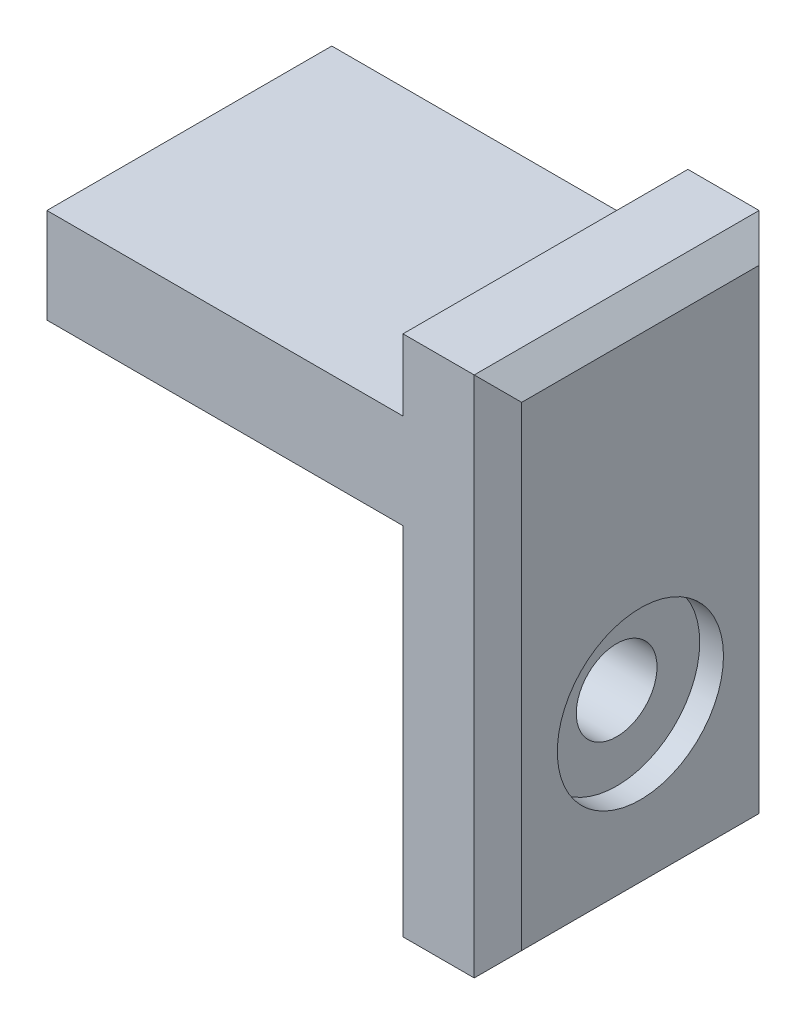
ISO-10303-21;
HEADER;
FILE_DESCRIPTION(('STEP AP214'),'2;1');
FILE_NAME('part.step','',(''),(''),'','','');
FILE_SCHEMA(('AUTOMOTIVE_DESIGN { 1 0 10303 214 1 1 1 1 }'));
ENDSEC;
DATA;
#1=APPLICATION_CONTEXT('core data for automotive mechanical design processes');
#2=APPLICATION_PROTOCOL_DEFINITION('international standard','automotive_design',2000,#1);
#3=PRODUCT_CONTEXT('',#1,'mechanical');
#4=PRODUCT('Part','Part','',(#3));
#5=PRODUCT_RELATED_PRODUCT_CATEGORY('part','',(#4));
#6=PRODUCT_DEFINITION_FORMATION('','',#4);
#7=PRODUCT_DEFINITION_CONTEXT('part definition',#1,'design');
#8=PRODUCT_DEFINITION('design','',#6,#7);
#9=PRODUCT_DEFINITION_SHAPE('','',#8);
#10=(LENGTH_UNIT() NAMED_UNIT(*) SI_UNIT(.MILLI.,.METRE.));
#11=(NAMED_UNIT(*) PLANE_ANGLE_UNIT() SI_UNIT($,.RADIAN.));
#12=(NAMED_UNIT(*) SI_UNIT($,.STERADIAN.) SOLID_ANGLE_UNIT());
#13=UNCERTAINTY_MEASURE_WITH_UNIT(LENGTH_MEASURE(1.E-05),#10,'distance_accuracy_value','');
#14=(GEOMETRIC_REPRESENTATION_CONTEXT(3) GLOBAL_UNCERTAINTY_ASSIGNED_CONTEXT((#13)) GLOBAL_UNIT_ASSIGNED_CONTEXT((#10,
#11,#12)) REPRESENTATION_CONTEXT('',''));
#15=CARTESIAN_POINT('',(0.,0.,0.));
#16=DIRECTION('',(0.,0.,1.));
#17=DIRECTION('',(1.,0.,0.));
#18=AXIS2_PLACEMENT_3D('',#15,#16,#17);
#19=CARTESIAN_POINT('',(27.,7.5,6.));
#20=DIRECTION('',(-1.,0.,0.));
#21=DIRECTION('',(0.,-1.,0.));
#22=AXIS2_PLACEMENT_3D('',#19,#20,#21);
#23=CYLINDRICAL_SURFACE('',#22,1.7);
#24=CARTESIAN_POINT('',(15.,7.5,6.));
#25=DIRECTION('',(-1.,0.,0.));
#26=DIRECTION('',(0.,-1.,0.));
#27=AXIS2_PLACEMENT_3D('',#24,#25,#26);
#28=CIRCLE('',#27,1.7);
#29=CARTESIAN_POINT('',(15.,5.8,6.));
#30=VERTEX_POINT('',#29);
#31=EDGE_CURVE('E144',#30,#30,#28,.T.);
#32=ORIENTED_EDGE('',*,*,#31,.T.);
#33=EDGE_LOOP('',(#32));
#34=FACE_BOUND('',#33,.T.);
#35=CARTESIAN_POINT('',(18.,7.5,6.));
#36=DIRECTION('',(1.,0.,0.));
#37=DIRECTION('',(0.,0.,-1.));
#38=AXIS2_PLACEMENT_3D('',#35,#36,#37);
#39=CIRCLE('',#38,1.7);
#40=CARTESIAN_POINT('',(18.,7.5,4.3));
#41=VERTEX_POINT('',#40);
#42=EDGE_CURVE('E142',#41,#41,#39,.F.);
#43=ORIENTED_EDGE('',*,*,#42,.F.);
#44=EDGE_LOOP('',(#43));
#45=FACE_BOUND('',#44,.T.);
#46=ADVANCED_FACE('F35',(#34,#45),#23,.F.);
#47=CARTESIAN_POINT('',(15.,0.,12.));
#48=DIRECTION('',(1.,0.,0.));
#49=DIRECTION('',(0.,1.,0.));
#50=AXIS2_PLACEMENT_3D('',#47,#48,#49);
#51=PLANE('',#50);
#52=ORIENTED_EDGE('',*,*,#31,.F.);
#53=EDGE_LOOP('',(#52));
#54=FACE_BOUND('',#53,.T.);
#55=DIRECTION('',(0.,-1.,0.));
#56=VECTOR('',#55,1.);
#57=CARTESIAN_POINT('',(15.,0.,0.));
#58=LINE('',#57,#56);
#59=CARTESIAN_POINT('',(15.,15.,0.));
#60=VERTEX_POINT('',#59);
#61=CARTESIAN_POINT('',(15.,0.,0.));
#62=VERTEX_POINT('',#61);
#63=EDGE_CURVE('E131',#60,#62,#58,.T.);
#64=ORIENTED_EDGE('',*,*,#63,.T.);
#65=DIRECTION('',(0.,0.,-1.));
#66=VECTOR('',#65,1.);
#67=CARTESIAN_POINT('',(15.,0.,12.));
#68=LINE('',#67,#66);
#69=CARTESIAN_POINT('',(15.,0.,12.));
#70=VERTEX_POINT('',#69);
#71=EDGE_CURVE('E115',#70,#62,#68,.T.);
#72=ORIENTED_EDGE('',*,*,#71,.F.);
#73=DIRECTION('',(0.,-1.,0.));
#74=VECTOR('',#73,1.);
#75=CARTESIAN_POINT('',(15.,0.,12.));
#76=LINE('',#75,#74);
#77=CARTESIAN_POINT('',(15.,15.,12.));
#78=VERTEX_POINT('',#77);
#79=EDGE_CURVE('E118',#78,#70,#76,.T.);
#80=ORIENTED_EDGE('',*,*,#79,.F.);
#81=DIRECTION('',(0.,0.,-1.));
#82=VECTOR('',#81,1.);
#83=CARTESIAN_POINT('',(15.,15.,12.));
#84=LINE('',#83,#82);
#85=EDGE_CURVE('E189',#78,#60,#84,.T.);
#86=ORIENTED_EDGE('',*,*,#85,.T.);
#87=EDGE_LOOP('',(#64,#72,#80,#86));
#88=FACE_BOUND('',#87,.T.);
#89=ADVANCED_FACE('F129',(#54,#88),#51,.F.);
#90=CARTESIAN_POINT('',(15.,0.,12.));
#91=DIRECTION('',(0.,1.,0.));
#92=DIRECTION('',(0.,0.,1.));
#93=AXIS2_PLACEMENT_3D('',#90,#91,#92);
#94=PLANE('',#93);
#95=DIRECTION('',(1.,0.,0.));
#96=VECTOR('',#95,1.);
#97=CARTESIAN_POINT('',(15.,0.,0.));
#98=LINE('',#97,#96);
#99=CARTESIAN_POINT('',(18.,0.,0.));
#100=VERTEX_POINT('',#99);
#101=EDGE_CURVE('E191',#62,#100,#98,.T.);
#102=ORIENTED_EDGE('',*,*,#101,.T.);
#103=DIRECTION('',(0.,0.,1.));
#104=VECTOR('',#103,1.);
#105=CARTESIAN_POINT('',(18.,0.,12.));
#106=LINE('',#105,#104);
#107=CARTESIAN_POINT('',(18.,0.,12.));
#108=VERTEX_POINT('',#107);
#109=EDGE_CURVE('E59',#100,#108,#106,.T.);
#110=ORIENTED_EDGE('',*,*,#109,.T.);
#111=DIRECTION('',(1.,0.,0.));
#112=VECTOR('',#111,1.);
#113=CARTESIAN_POINT('',(15.,0.,12.));
#114=LINE('',#113,#112);
#115=EDGE_CURVE('E111',#70,#108,#114,.T.);
#116=ORIENTED_EDGE('',*,*,#115,.F.);
#117=ORIENTED_EDGE('',*,*,#71,.T.);
#118=EDGE_LOOP('',(#102,#110,#116,#117));
#119=FACE_BOUND('',#118,.T.);
#120=ADVANCED_FACE('F113',(#119),#94,.F.);
#121=CARTESIAN_POINT('',(19.,19.,12.));
#122=DIRECTION('',(-1.,0.,0.));
#123=DIRECTION('',(0.,0.,1.));
#124=AXIS2_PLACEMENT_3D('',#121,#122,#123);
#125=PLANE('',#124);
#126=DIRECTION('',(0.,0.,-1.));
#127=VECTOR('',#126,1.);
#128=CARTESIAN_POINT('',(19.,1.,12.));
#129=LINE('',#128,#127);
#130=CARTESIAN_POINT('',(19.,1.,11.));
#131=VERTEX_POINT('',#130);
#132=CARTESIAN_POINT('',(19.,1.,1.));
#133=VERTEX_POINT('',#132);
#134=EDGE_CURVE('E148',#131,#133,#129,.T.);
#135=ORIENTED_EDGE('',*,*,#134,.T.);
#136=DIRECTION('',(0.,1.,0.));
#137=VECTOR('',#136,1.);
#138=CARTESIAN_POINT('',(19.,22.,1.));
#139=LINE('',#138,#137);
#140=CARTESIAN_POINT('',(19.,21.,1.));
#141=VERTEX_POINT('',#140);
#142=EDGE_CURVE('E150',#133,#141,#139,.T.);
#143=ORIENTED_EDGE('',*,*,#142,.T.);
#144=DIRECTION('',(0.,0.,1.));
#145=VECTOR('',#144,1.);
#146=CARTESIAN_POINT('',(19.,21.,12.));
#147=LINE('',#146,#145);
#148=CARTESIAN_POINT('',(19.,21.,11.));
#149=VERTEX_POINT('',#148);
#150=EDGE_CURVE('E132',#141,#149,#147,.T.);
#151=ORIENTED_EDGE('',*,*,#150,.T.);
#152=DIRECTION('',(0.,-1.,0.));
#153=VECTOR('',#152,1.);
#154=CARTESIAN_POINT('',(19.,19.,11.));
#155=LINE('',#154,#153);
#156=EDGE_CURVE('E135',#149,#131,#155,.T.);
#157=ORIENTED_EDGE('',*,*,#156,.T.);
#158=EDGE_LOOP('',(#135,#143,#151,#157));
#159=FACE_BOUND('',#158,.T.);
#160=CARTESIAN_POINT('',(19.,7.5,6.));
#161=DIRECTION('',(1.,0.,0.));
#162=DIRECTION('',(0.,0.,-1.));
#163=AXIS2_PLACEMENT_3D('',#160,#161,#162);
#164=CIRCLE('',#163,3.5);
#165=CARTESIAN_POINT('',(19.,7.5,2.5));
#166=VERTEX_POINT('',#165);
#167=EDGE_CURVE('E168',#166,#166,#164,.T.);
#168=ORIENTED_EDGE('',*,*,#167,.F.);
#169=EDGE_LOOP('',(#168));
#170=FACE_BOUND('',#169,.T.);
#171=ADVANCED_FACE('F238',(#159,#170),#125,.F.);
#172=CARTESIAN_POINT('',(19.,22.,12.));
#173=DIRECTION('',(0.,-1.,0.));
#174=DIRECTION('',(0.,0.,-1.));
#175=AXIS2_PLACEMENT_3D('',#172,#173,#174);
#176=PLANE('',#175);
#177=DIRECTION('',(-1.,0.,0.));
#178=VECTOR('',#177,1.);
#179=CARTESIAN_POINT('',(19.,22.,12.));
#180=LINE('',#179,#178);
#181=CARTESIAN_POINT('',(18.,22.,12.));
#182=VERTEX_POINT('',#181);
#183=CARTESIAN_POINT('',(15.,22.,12.));
#184=VERTEX_POINT('',#183);
#185=EDGE_CURVE('E117',#182,#184,#180,.T.);
#186=ORIENTED_EDGE('',*,*,#185,.F.);
#187=DIRECTION('',(0.,0.,-1.));
#188=VECTOR('',#187,1.);
#189=CARTESIAN_POINT('',(18.,22.,12.));
#190=LINE('',#189,#188);
#191=CARTESIAN_POINT('',(18.,22.,0.));
#192=VERTEX_POINT('',#191);
#193=EDGE_CURVE('E11',#182,#192,#190,.T.);
#194=ORIENTED_EDGE('',*,*,#193,.T.);
#195=DIRECTION('',(-1.,0.,0.));
#196=VECTOR('',#195,1.);
#197=CARTESIAN_POINT('',(19.,22.,0.));
#198=LINE('',#197,#196);
#199=CARTESIAN_POINT('',(15.,22.,0.));
#200=VERTEX_POINT('',#199);
#201=EDGE_CURVE('E193',#192,#200,#198,.T.);
#202=ORIENTED_EDGE('',*,*,#201,.T.);
#203=DIRECTION('',(0.,0.,-1.));
#204=VECTOR('',#203,1.);
#205=CARTESIAN_POINT('',(15.,22.,12.));
#206=LINE('',#205,#204);
#207=EDGE_CURVE('E133',#184,#200,#206,.T.);
#208=ORIENTED_EDGE('',*,*,#207,.F.);
#209=EDGE_LOOP('',(#186,#194,#202,#208));
#210=FACE_BOUND('',#209,.T.);
#211=ADVANCED_FACE('F275',(#210),#176,.F.);
#212=CARTESIAN_POINT('',(15.,22.,12.));
#213=DIRECTION('',(1.,0.,0.));
#214=DIRECTION('',(0.,0.,-1.));
#215=AXIS2_PLACEMENT_3D('',#212,#213,#214);
#216=PLANE('',#215);
#217=DIRECTION('',(0.,-1.,0.));
#218=VECTOR('',#217,1.);
#219=CARTESIAN_POINT('',(15.,22.,0.));
#220=LINE('',#219,#218);
#221=CARTESIAN_POINT('',(15.,19.,0.));
#222=VERTEX_POINT('',#221);
#223=EDGE_CURVE('E195',#200,#222,#220,.T.);
#224=ORIENTED_EDGE('',*,*,#223,.T.);
#225=DIRECTION('',(0.,0.,-1.));
#226=VECTOR('',#225,1.);
#227=CARTESIAN_POINT('',(15.,19.,12.));
#228=LINE('',#227,#226);
#229=CARTESIAN_POINT('',(15.,19.,12.));
#230=VERTEX_POINT('',#229);
#231=EDGE_CURVE('E138',#230,#222,#228,.T.);
#232=ORIENTED_EDGE('',*,*,#231,.F.);
#233=DIRECTION('',(0.,-1.,0.));
#234=VECTOR('',#233,1.);
#235=CARTESIAN_POINT('',(15.,22.,12.));
#236=LINE('',#235,#234);
#237=EDGE_CURVE('E182',#184,#230,#236,.T.);
#238=ORIENTED_EDGE('',*,*,#237,.F.);
#239=ORIENTED_EDGE('',*,*,#207,.T.);
#240=EDGE_LOOP('',(#224,#232,#238,#239));
#241=FACE_BOUND('',#240,.T.);
#242=ADVANCED_FACE('F272',(#241),#216,.F.);
#243=CARTESIAN_POINT('',(0.,19.,12.));
#244=DIRECTION('',(0.,-1.,0.));
#245=DIRECTION('',(0.,0.,-1.));
#246=AXIS2_PLACEMENT_3D('',#243,#244,#245);
#247=PLANE('',#246);
#248=DIRECTION('',(-1.,0.,0.));
#249=VECTOR('',#248,1.);
#250=CARTESIAN_POINT('',(0.,19.,0.));
#251=LINE('',#250,#249);
#252=CARTESIAN_POINT('',(0.,19.,0.));
#253=VERTEX_POINT('',#252);
#254=EDGE_CURVE('E197',#222,#253,#251,.T.);
#255=ORIENTED_EDGE('',*,*,#254,.T.);
#256=DIRECTION('',(0.,0.,-1.));
#257=VECTOR('',#256,1.);
#258=CARTESIAN_POINT('',(0.,19.,12.));
#259=LINE('',#258,#257);
#260=CARTESIAN_POINT('',(0.,19.,12.));
#261=VERTEX_POINT('',#260);
#262=EDGE_CURVE('E206',#261,#253,#259,.T.);
#263=ORIENTED_EDGE('',*,*,#262,.F.);
#264=DIRECTION('',(-1.,0.,0.));
#265=VECTOR('',#264,1.);
#266=CARTESIAN_POINT('',(0.,19.,12.));
#267=LINE('',#266,#265);
#268=EDGE_CURVE('E184',#230,#261,#267,.T.);
#269=ORIENTED_EDGE('',*,*,#268,.F.);
#270=ORIENTED_EDGE('',*,*,#231,.T.);
#271=EDGE_LOOP('',(#255,#263,#269,#270));
#272=FACE_BOUND('',#271,.T.);
#273=ADVANCED_FACE('F213',(#272),#247,.F.);
#274=CARTESIAN_POINT('',(0.,15.,12.));
#275=DIRECTION('',(1.,0.,0.));
#276=DIRECTION('',(0.,0.,-1.));
#277=AXIS2_PLACEMENT_3D('',#274,#275,#276);
#278=PLANE('',#277);
#279=DIRECTION('',(0.,-1.,0.));
#280=VECTOR('',#279,1.);
#281=CARTESIAN_POINT('',(0.,15.,0.));
#282=LINE('',#281,#280);
#283=CARTESIAN_POINT('',(0.,15.,0.));
#284=VERTEX_POINT('',#283);
#285=EDGE_CURVE('E199',#253,#284,#282,.T.);
#286=ORIENTED_EDGE('',*,*,#285,.T.);
#287=DIRECTION('',(0.,0.,-1.));
#288=VECTOR('',#287,1.);
#289=CARTESIAN_POINT('',(0.,15.,12.));
#290=LINE('',#289,#288);
#291=CARTESIAN_POINT('',(0.,15.,12.));
#292=VERTEX_POINT('',#291);
#293=EDGE_CURVE('E203',#292,#284,#290,.T.);
#294=ORIENTED_EDGE('',*,*,#293,.F.);
#295=DIRECTION('',(0.,-1.,0.));
#296=VECTOR('',#295,1.);
#297=CARTESIAN_POINT('',(0.,15.,12.));
#298=LINE('',#297,#296);
#299=EDGE_CURVE('E186',#261,#292,#298,.T.);
#300=ORIENTED_EDGE('',*,*,#299,.F.);
#301=ORIENTED_EDGE('',*,*,#262,.T.);
#302=EDGE_LOOP('',(#286,#294,#300,#301));
#303=FACE_BOUND('',#302,.T.);
#304=ADVANCED_FACE('F225',(#303),#278,.F.);
#305=CARTESIAN_POINT('',(0.,15.,12.));
#306=DIRECTION('',(0.,1.,0.));
#307=DIRECTION('',(0.,0.,1.));
#308=AXIS2_PLACEMENT_3D('',#305,#306,#307);
#309=PLANE('',#308);
#310=DIRECTION('',(1.,0.,0.));
#311=VECTOR('',#310,1.);
#312=CARTESIAN_POINT('',(0.,15.,0.));
#313=LINE('',#312,#311);
#314=EDGE_CURVE('E127',#284,#60,#313,.T.);
#315=ORIENTED_EDGE('',*,*,#314,.T.);
#316=ORIENTED_EDGE('',*,*,#85,.F.);
#317=DIRECTION('',(1.,0.,0.));
#318=VECTOR('',#317,1.);
#319=CARTESIAN_POINT('',(0.,15.,12.));
#320=LINE('',#319,#318);
#321=EDGE_CURVE('E123',#292,#78,#320,.T.);
#322=ORIENTED_EDGE('',*,*,#321,.F.);
#323=ORIENTED_EDGE('',*,*,#293,.T.);
#324=EDGE_LOOP('',(#315,#316,#322,#323));
#325=FACE_BOUND('',#324,.T.);
#326=ADVANCED_FACE('F228',(#325),#309,.F.);
#327=CARTESIAN_POINT('',(0.,0.,12.));
#328=DIRECTION('',(0.,0.,-1.));
#329=DIRECTION('',(-1.,0.,0.));
#330=AXIS2_PLACEMENT_3D('',#327,#328,#329);
#331=PLANE('',#330);
#332=ORIENTED_EDGE('',*,*,#115,.T.);
#333=DIRECTION('',(0.,1.,0.));
#334=VECTOR('',#333,1.);
#335=CARTESIAN_POINT('',(18.,0.,12.));
#336=LINE('',#335,#334);
#337=EDGE_CURVE('E44',#108,#182,#336,.T.);
#338=ORIENTED_EDGE('',*,*,#337,.T.);
#339=ORIENTED_EDGE('',*,*,#185,.T.);
#340=ORIENTED_EDGE('',*,*,#237,.T.);
#341=ORIENTED_EDGE('',*,*,#268,.T.);
#342=ORIENTED_EDGE('',*,*,#299,.T.);
#343=ORIENTED_EDGE('',*,*,#321,.T.);
#344=ORIENTED_EDGE('',*,*,#79,.T.);
#345=EDGE_LOOP('',(#332,#338,#339,#340,#341,#342,#343,#344));
#346=FACE_BOUND('',#345,.T.);
#347=ADVANCED_FACE('F121',(#346),#331,.F.);
#348=CARTESIAN_POINT('',(0.,0.,0.));
#349=DIRECTION('',(0.,0.,-1.));
#350=DIRECTION('',(-1.,0.,0.));
#351=AXIS2_PLACEMENT_3D('',#348,#349,#350);
#352=PLANE('',#351);
#353=ORIENTED_EDGE('',*,*,#201,.F.);
#354=DIRECTION('',(0.,-1.,0.));
#355=VECTOR('',#354,1.);
#356=CARTESIAN_POINT('',(18.,0.,0.));
#357=LINE('',#356,#355);
#358=EDGE_CURVE('E153',#192,#100,#357,.T.);
#359=ORIENTED_EDGE('',*,*,#358,.T.);
#360=ORIENTED_EDGE('',*,*,#101,.F.);
#361=ORIENTED_EDGE('',*,*,#63,.F.);
#362=ORIENTED_EDGE('',*,*,#314,.F.);
#363=ORIENTED_EDGE('',*,*,#285,.F.);
#364=ORIENTED_EDGE('',*,*,#254,.F.);
#365=ORIENTED_EDGE('',*,*,#223,.F.);
#366=EDGE_LOOP('',(#353,#359,#360,#361,#362,#363,#364,#365));
#367=FACE_BOUND('',#366,.T.);
#368=ADVANCED_FACE('F221',(#367),#352,.T.);
#369=CARTESIAN_POINT('',(18.,7.5,6.));
#370=DIRECTION('',(1.,0.,0.));
#371=DIRECTION('',(0.,0.,-1.));
#372=AXIS2_PLACEMENT_3D('',#369,#370,#371);
#373=PLANE('',#372);
#374=CARTESIAN_POINT('',(18.,7.5,6.));
#375=DIRECTION('',(1.,0.,0.));
#376=DIRECTION('',(0.,0.,-1.));
#377=AXIS2_PLACEMENT_3D('',#374,#375,#376);
#378=CIRCLE('',#377,3.5);
#379=CARTESIAN_POINT('',(18.,7.5,2.5));
#380=VERTEX_POINT('',#379);
#381=EDGE_CURVE('E145',#380,#380,#378,.T.);
#382=ORIENTED_EDGE('',*,*,#381,.T.);
#383=EDGE_LOOP('',(#382));
#384=FACE_BOUND('',#383,.T.);
#385=ORIENTED_EDGE('',*,*,#42,.T.);
#386=EDGE_LOOP('',(#385));
#387=FACE_BOUND('',#386,.T.);
#388=ADVANCED_FACE('F265',(#384,#387),#373,.T.);
#389=CARTESIAN_POINT('',(18.,7.5,6.));
#390=DIRECTION('',(1.,0.,0.));
#391=DIRECTION('',(0.,0.,-1.));
#392=AXIS2_PLACEMENT_3D('',#389,#390,#391);
#393=CYLINDRICAL_SURFACE('',#392,3.5);
#394=ORIENTED_EDGE('',*,*,#381,.F.);
#395=EDGE_LOOP('',(#394));
#396=FACE_BOUND('',#395,.T.);
#397=ORIENTED_EDGE('',*,*,#167,.T.);
#398=EDGE_LOOP('',(#397));
#399=FACE_BOUND('',#398,.T.);
#400=ADVANCED_FACE('F247',(#396,#399),#393,.F.);
#401=CARTESIAN_POINT('',(18.,0.,12.));
#402=DIRECTION('',(-0.70710678118655,0.,-0.707106781186545));
#403=DIRECTION('',(0.,1.,0.));
#404=AXIS2_PLACEMENT_3D('',#401,#402,#403);
#405=PLANE('',#404);
#406=DIRECTION('',(0.577350269189623,-0.577350269189627,-0.577350269189627));
#407=VECTOR('',#406,1.);
#408=CARTESIAN_POINT('',(18.,22.,12.));
#409=LINE('',#408,#407);
#410=EDGE_CURVE('E161',#182,#149,#409,.T.);
#411=ORIENTED_EDGE('',*,*,#410,.F.);
#412=ORIENTED_EDGE('',*,*,#337,.F.);
#413=DIRECTION('',(0.577350269189623,0.577350269189627,-0.577350269189627));
#414=VECTOR('',#413,1.);
#415=CARTESIAN_POINT('',(18.,0.,12.));
#416=LINE('',#415,#414);
#417=EDGE_CURVE('E39',#131,#108,#416,.F.);
#418=ORIENTED_EDGE('',*,*,#417,.F.);
#419=ORIENTED_EDGE('',*,*,#156,.F.);
#420=EDGE_LOOP('',(#411,#412,#418,#419));
#421=FACE_BOUND('',#420,.T.);
#422=ADVANCED_FACE('F37',(#421),#405,.F.);
#423=CARTESIAN_POINT('',(19.,1.,12.));
#424=DIRECTION('',(-0.70710678118655,0.707106781186545,0.));
#425=DIRECTION('',(0.,0.,-1.));
#426=AXIS2_PLACEMENT_3D('',#423,#424,#425);
#427=PLANE('',#426);
#428=ORIENTED_EDGE('',*,*,#417,.T.);
#429=ORIENTED_EDGE('',*,*,#109,.F.);
#430=DIRECTION('',(-0.577350269189623,-0.577350269189627,-0.577350269189627));
#431=VECTOR('',#430,1.);
#432=CARTESIAN_POINT('',(22.6666666666667,4.66666666666669,4.66666666666669));
#433=LINE('',#432,#431);
#434=EDGE_CURVE('E160',#133,#100,#433,.T.);
#435=ORIENTED_EDGE('',*,*,#434,.F.);
#436=ORIENTED_EDGE('',*,*,#134,.F.);
#437=EDGE_LOOP('',(#428,#429,#435,#436));
#438=FACE_BOUND('',#437,.T.);
#439=ADVANCED_FACE('F240',(#438),#427,.F.);
#440=CARTESIAN_POINT('',(18.,22.,12.));
#441=DIRECTION('',(-0.70710678118655,-0.707106781186545,0.));
#442=DIRECTION('',(0.,0.,-1.));
#443=AXIS2_PLACEMENT_3D('',#440,#441,#442);
#444=PLANE('',#443);
#445=ORIENTED_EDGE('',*,*,#410,.T.);
#446=ORIENTED_EDGE('',*,*,#150,.F.);
#447=DIRECTION('',(0.577350269189623,-0.577350269189627,0.577350269189627));
#448=VECTOR('',#447,1.);
#449=CARTESIAN_POINT('',(22.,18.,4.00000000000002));
#450=LINE('',#449,#448);
#451=EDGE_CURVE('E158',#192,#141,#450,.T.);
#452=ORIENTED_EDGE('',*,*,#451,.F.);
#453=ORIENTED_EDGE('',*,*,#193,.F.);
#454=EDGE_LOOP('',(#445,#446,#452,#453));
#455=FACE_BOUND('',#454,.T.);
#456=ADVANCED_FACE('F235',(#455),#444,.F.);
#457=CARTESIAN_POINT('',(19.,19.,1.));
#458=DIRECTION('',(0.70710678118655,0.,-0.707106781186545));
#459=DIRECTION('',(0.,-1.,0.));
#460=AXIS2_PLACEMENT_3D('',#457,#458,#459);
#461=PLANE('',#460);
#462=ORIENTED_EDGE('',*,*,#434,.T.);
#463=ORIENTED_EDGE('',*,*,#358,.F.);
#464=ORIENTED_EDGE('',*,*,#451,.T.);
#465=ORIENTED_EDGE('',*,*,#142,.F.);
#466=EDGE_LOOP('',(#462,#463,#464,#465));
#467=FACE_BOUND('',#466,.T.);
#468=ADVANCED_FACE('F232',(#467),#461,.T.);
#469=CLOSED_SHELL('',(#46,#89,#120,#171,#211,#242,#273,#304,#326,#347,#368,#388,#400,#422,#439,
#456,#468));
#470=MANIFOLD_SOLID_BREP('B2',#469);
#471=ADVANCED_BREP_SHAPE_REPRESENTATION('',(#18,#470),#14);
#472=SHAPE_DEFINITION_REPRESENTATION(#9,#471);
ENDSEC;
END-ISO-10303-21;
